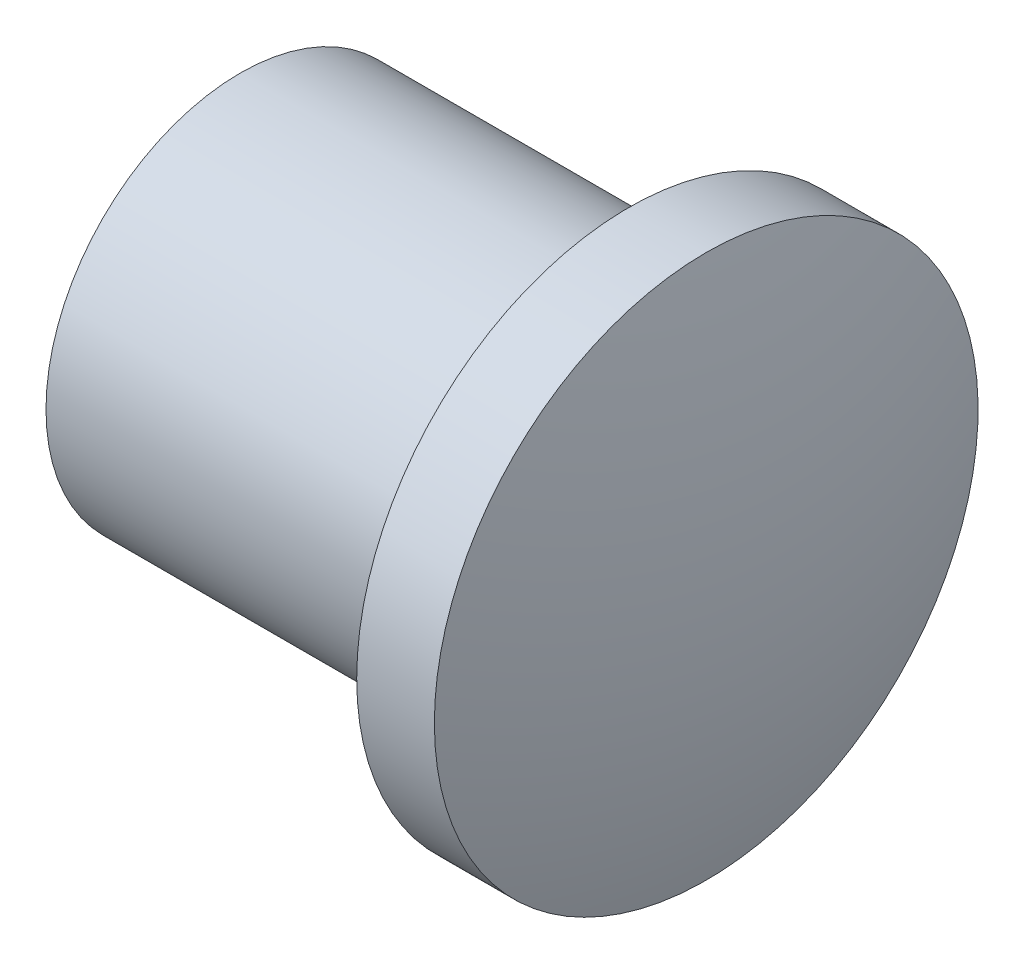
ISO-10303-21;
HEADER;
FILE_DESCRIPTION(('STEP AP214'),'2;1');
FILE_NAME('part.step','',(''),(''),'','','');
FILE_SCHEMA(('AUTOMOTIVE_DESIGN { 1 0 10303 214 1 1 1 1 }'));
ENDSEC;
DATA;
#1=APPLICATION_CONTEXT('core data for automotive mechanical design processes');
#2=APPLICATION_PROTOCOL_DEFINITION('international standard','automotive_design',2000,#1);
#3=PRODUCT_CONTEXT('',#1,'mechanical');
#4=PRODUCT('Part','Part','',(#3));
#5=PRODUCT_RELATED_PRODUCT_CATEGORY('part','',(#4));
#6=PRODUCT_DEFINITION_FORMATION('','',#4);
#7=PRODUCT_DEFINITION_CONTEXT('part definition',#1,'design');
#8=PRODUCT_DEFINITION('design','',#6,#7);
#9=PRODUCT_DEFINITION_SHAPE('','',#8);
#10=(LENGTH_UNIT() NAMED_UNIT(*) SI_UNIT(.MILLI.,.METRE.));
#11=(NAMED_UNIT(*) PLANE_ANGLE_UNIT() SI_UNIT($,.RADIAN.));
#12=(NAMED_UNIT(*) SI_UNIT($,.STERADIAN.) SOLID_ANGLE_UNIT());
#13=UNCERTAINTY_MEASURE_WITH_UNIT(LENGTH_MEASURE(1.E-05),#10,'distance_accuracy_value','');
#14=(GEOMETRIC_REPRESENTATION_CONTEXT(3) GLOBAL_UNCERTAINTY_ASSIGNED_CONTEXT((#13)) GLOBAL_UNIT_ASSIGNED_CONTEXT((#10,
#11,#12)) REPRESENTATION_CONTEXT('',''));
#15=CARTESIAN_POINT('',(0.,0.,0.));
#16=DIRECTION('',(0.,0.,1.));
#17=DIRECTION('',(1.,0.,0.));
#18=AXIS2_PLACEMENT_3D('',#15,#16,#17);
#19=CARTESIAN_POINT('',(-24.,0.,0.));
#20=DIRECTION('',(-1.,0.,0.));
#21=DIRECTION('',(0.,1.,0.));
#22=AXIS2_PLACEMENT_3D('',#19,#20,#21);
#23=SPHERICAL_SURFACE('',#22,24.);
#24=CARTESIAN_POINT('',(-1.04351943350201,0.,0.));
#25=DIRECTION('',(-1.,0.,0.));
#26=DIRECTION('',(0.,0.,1.));
#27=AXIS2_PLACEMENT_3D('',#24,#25,#26);
#28=CIRCLE('',#27,7.);
#29=CARTESIAN_POINT('',(-1.04351943350201,0.,7.));
#30=VERTEX_POINT('',#29);
#31=EDGE_CURVE('E56',#30,#30,#28,.T.);
#32=ORIENTED_EDGE('',*,*,#31,.F.);
#33=EDGE_LOOP('',(#32));
#34=FACE_BOUND('',#33,.T.);
#35=ADVANCED_FACE('F37',(#34),#23,.T.);
#36=CARTESIAN_POINT('',(-3.04351943350201,0.,0.));
#37=DIRECTION('',(-1.,0.,0.));
#38=DIRECTION('',(0.,0.,1.));
#39=AXIS2_PLACEMENT_3D('',#36,#37,#38);
#40=CYLINDRICAL_SURFACE('',#39,7.);
#41=CARTESIAN_POINT('',(-3.04351943350201,0.,0.));
#42=DIRECTION('',(-1.,0.,0.));
#43=DIRECTION('',(0.,0.,1.));
#44=AXIS2_PLACEMENT_3D('',#41,#42,#43);
#45=CIRCLE('',#44,7.);
#46=CARTESIAN_POINT('',(-3.04351943350201,0.,7.));
#47=VERTEX_POINT('',#46);
#48=EDGE_CURVE('E62',#47,#47,#45,.T.);
#49=ORIENTED_EDGE('',*,*,#48,.F.);
#50=EDGE_LOOP('',(#49));
#51=FACE_BOUND('',#50,.T.);
#52=ORIENTED_EDGE('',*,*,#31,.T.);
#53=EDGE_LOOP('',(#52));
#54=FACE_BOUND('',#53,.T.);
#55=ADVANCED_FACE('F70',(#51,#54),#40,.T.);
#56=CARTESIAN_POINT('',(-3.04351943350201,7.,0.));
#57=DIRECTION('',(1.,0.,0.));
#58=DIRECTION('',(0.,0.,-1.));
#59=AXIS2_PLACEMENT_3D('',#56,#57,#58);
#60=PLANE('',#59);
#61=CARTESIAN_POINT('',(-3.04351943350201,0.,0.));
#62=DIRECTION('',(-1.,0.,0.));
#63=DIRECTION('',(0.,0.,1.));
#64=AXIS2_PLACEMENT_3D('',#61,#62,#63);
#65=CIRCLE('',#64,5.);
#66=CARTESIAN_POINT('',(-3.04351943350201,0.,5.));
#67=VERTEX_POINT('',#66);
#68=EDGE_CURVE('E50',#67,#67,#65,.T.);
#69=ORIENTED_EDGE('',*,*,#68,.F.);
#70=EDGE_LOOP('',(#69));
#71=FACE_BOUND('',#70,.T.);
#72=ORIENTED_EDGE('',*,*,#48,.T.);
#73=EDGE_LOOP('',(#72));
#74=FACE_BOUND('',#73,.T.);
#75=ADVANCED_FACE('F76',(#71,#74),#60,.F.);
#76=CARTESIAN_POINT('',(-13.043519433502,0.,0.));
#77=DIRECTION('',(1.,0.,0.));
#78=DIRECTION('',(0.,0.,-1.));
#79=AXIS2_PLACEMENT_3D('',#76,#77,#78);
#80=CYLINDRICAL_SURFACE('',#79,5.);
#81=CARTESIAN_POINT('',(-13.043519433502,0.,0.));
#82=DIRECTION('',(-1.,0.,0.));
#83=DIRECTION('',(0.,0.,1.));
#84=AXIS2_PLACEMENT_3D('',#81,#82,#83);
#85=CIRCLE('',#84,5.);
#86=CARTESIAN_POINT('',(-13.043519433502,0.,5.));
#87=VERTEX_POINT('',#86);
#88=EDGE_CURVE('E59',#87,#87,#85,.T.);
#89=ORIENTED_EDGE('',*,*,#88,.F.);
#90=EDGE_LOOP('',(#89));
#91=FACE_BOUND('',#90,.T.);
#92=ORIENTED_EDGE('',*,*,#68,.T.);
#93=EDGE_LOOP('',(#92));
#94=FACE_BOUND('',#93,.T.);
#95=ADVANCED_FACE('F82',(#91,#94),#80,.T.);
#96=CARTESIAN_POINT('',(-13.043519433502,0.,0.));
#97=DIRECTION('',(-1.,0.,0.));
#98=DIRECTION('',(0.,0.,1.));
#99=AXIS2_PLACEMENT_3D('',#96,#97,#98);
#100=PLANE('',#99);
#101=CARTESIAN_POINT('',(-13.043519433502,0.,0.));
#102=DIRECTION('',(-1.,0.,0.));
#103=DIRECTION('',(0.,0.,1.));
#104=AXIS2_PLACEMENT_3D('',#101,#102,#103);
#105=CIRCLE('',#104,4.5);
#106=CARTESIAN_POINT('',(-13.043519433502,0.,4.5));
#107=VERTEX_POINT('',#106);
#108=EDGE_CURVE('E45',#107,#107,#105,.T.);
#109=ORIENTED_EDGE('',*,*,#108,.F.);
#110=EDGE_LOOP('',(#109));
#111=FACE_BOUND('',#110,.T.);
#112=ORIENTED_EDGE('',*,*,#88,.T.);
#113=EDGE_LOOP('',(#112));
#114=FACE_BOUND('',#113,.T.);
#115=ADVANCED_FACE('F86',(#111,#114),#100,.T.);
#116=CARTESIAN_POINT('',(-14.043519433502,0.,0.));
#117=DIRECTION('',(-1.,0.,0.));
#118=DIRECTION('',(0.,0.,1.));
#119=AXIS2_PLACEMENT_3D('',#116,#117,#118);
#120=PLANE('',#119);
#121=CARTESIAN_POINT('',(-14.043519433502,0.,0.));
#122=DIRECTION('',(-1.,0.,0.));
#123=DIRECTION('',(0.,0.,1.));
#124=AXIS2_PLACEMENT_3D('',#121,#122,#123);
#125=CIRCLE('',#124,3.5);
#126=CARTESIAN_POINT('',(-14.043519433502,0.,3.5));
#127=VERTEX_POINT('',#126);
#128=EDGE_CURVE('E10',#127,#127,#125,.T.);
#129=ORIENTED_EDGE('',*,*,#128,.T.);
#130=EDGE_LOOP('',(#129));
#131=FACE_BOUND('',#130,.T.);
#132=ADVANCED_FACE('F90',(#131),#120,.T.);
#133=CARTESIAN_POINT('',(-14.043519433502,0.,0.));
#134=DIRECTION('',(1.,0.,0.));
#135=DIRECTION('',(0.,0.,-1.));
#136=AXIS2_PLACEMENT_3D('',#133,#134,#135);
#137=CONICAL_SURFACE('',#136,3.5,0.785398163397447);
#138=ORIENTED_EDGE('',*,*,#108,.T.);
#139=EDGE_LOOP('',(#138));
#140=FACE_BOUND('',#139,.T.);
#141=ORIENTED_EDGE('',*,*,#128,.F.);
#142=EDGE_LOOP('',(#141));
#143=FACE_BOUND('',#142,.T.);
#144=ADVANCED_FACE('F39',(#140,#143),#137,.T.);
#145=CLOSED_SHELL('',(#35,#55,#75,#95,#115,#132,#144));
#146=MANIFOLD_SOLID_BREP('B2',#145);
#147=ADVANCED_BREP_SHAPE_REPRESENTATION('',(#18,#146),#14);
#148=SHAPE_DEFINITION_REPRESENTATION(#9,#147);
ENDSEC;
END-ISO-10303-21;
